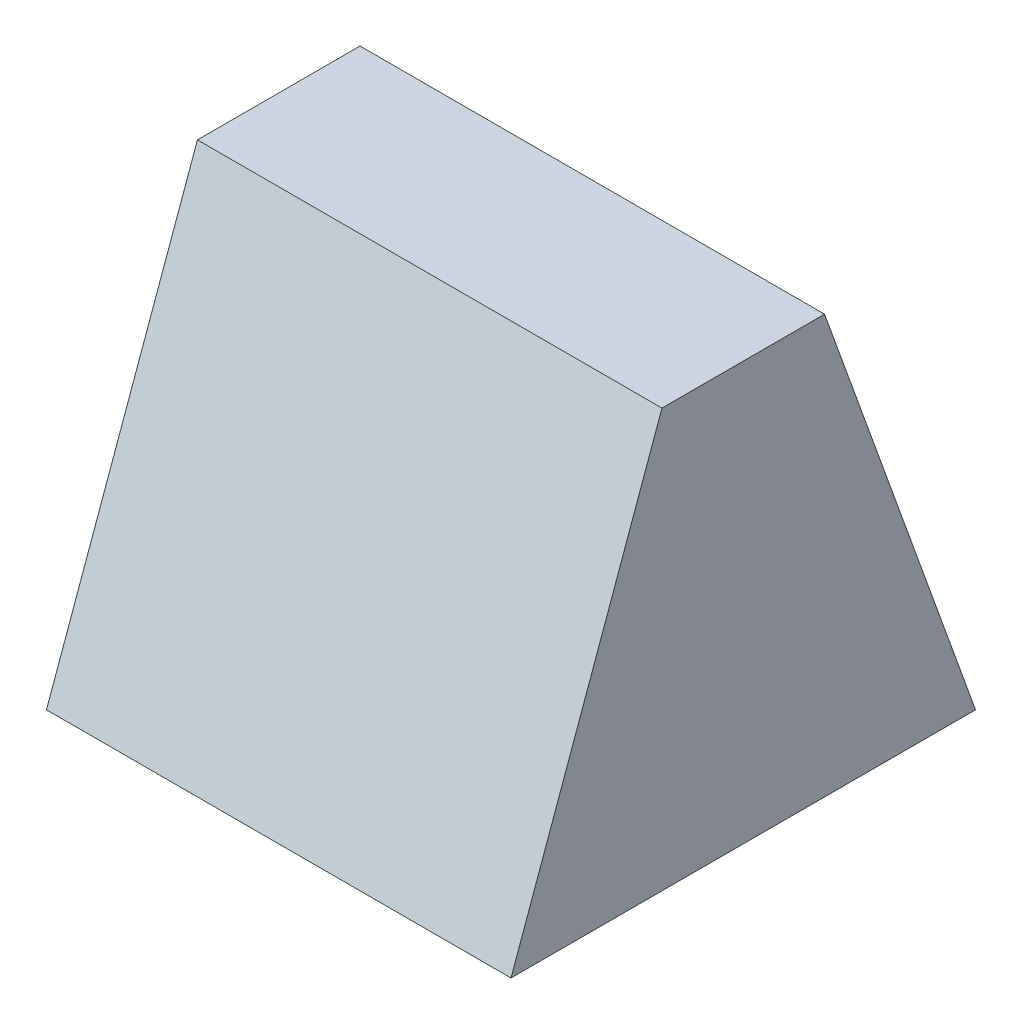
ISO-10303-21;
HEADER;
FILE_DESCRIPTION(('STEP AP214'),'2;1');
FILE_NAME('part.step','',(''),(''),'','','');
FILE_SCHEMA(('AUTOMOTIVE_DESIGN { 1 0 10303 214 1 1 1 1 }'));
ENDSEC;
DATA;
#1=APPLICATION_CONTEXT('core data for automotive mechanical design processes');
#2=APPLICATION_PROTOCOL_DEFINITION('international standard','automotive_design',2000,#1);
#3=PRODUCT_CONTEXT('',#1,'mechanical');
#4=PRODUCT('Part','Part','',(#3));
#5=PRODUCT_RELATED_PRODUCT_CATEGORY('part','',(#4));
#6=PRODUCT_DEFINITION_FORMATION('','',#4);
#7=PRODUCT_DEFINITION_CONTEXT('part definition',#1,'design');
#8=PRODUCT_DEFINITION('design','',#6,#7);
#9=PRODUCT_DEFINITION_SHAPE('','',#8);
#10=(LENGTH_UNIT() NAMED_UNIT(*) SI_UNIT(.MILLI.,.METRE.));
#11=(NAMED_UNIT(*) PLANE_ANGLE_UNIT() SI_UNIT($,.RADIAN.));
#12=(NAMED_UNIT(*) SI_UNIT($,.STERADIAN.) SOLID_ANGLE_UNIT());
#13=UNCERTAINTY_MEASURE_WITH_UNIT(LENGTH_MEASURE(1.E-05),#10,'distance_accuracy_value','');
#14=(GEOMETRIC_REPRESENTATION_CONTEXT(3) GLOBAL_UNCERTAINTY_ASSIGNED_CONTEXT((#13)) GLOBAL_UNIT_ASSIGNED_CONTEXT((#10,
#11,#12)) REPRESENTATION_CONTEXT('',''));
#15=CARTESIAN_POINT('',(0.,0.,0.));
#16=DIRECTION('',(0.,0.,1.));
#17=DIRECTION('',(1.,0.,0.));
#18=AXIS2_PLACEMENT_3D('',#15,#16,#17);
#19=CARTESIAN_POINT('',(-10.,-33.9259071882282,-179.19725595501));
#20=DIRECTION('',(0.,-0.339644463777557,-0.940553899691695));
#21=DIRECTION('',(0.,0.940553899691696,-0.339644463777557));
#22=AXIS2_PLACEMENT_3D('',#19,#20,#21);
#23=PLANE('',#22);
#24=DIRECTION('',(0.,0.940553899691695,-0.339644463777557));
#25=VECTOR('',#24,1.);
#26=CARTESIAN_POINT('',(0.,-33.9259071882282,-179.19725595501));
#27=LINE('',#26,#25);
#28=CARTESIAN_POINT('',(0.,-42.9259071882282,-175.94725595501));
#29=VERTEX_POINT('',#28);
#30=CARTESIAN_POINT('',(0.,-33.9259071882282,-179.19725595501));
#31=VERTEX_POINT('',#30);
#32=EDGE_CURVE('E96',#29,#31,#27,.T.);
#33=ORIENTED_EDGE('',*,*,#32,.T.);
#34=DIRECTION('',(1.,0.,0.));
#35=VECTOR('',#34,1.);
#36=CARTESIAN_POINT('',(-10.,-33.9259071882282,-179.19725595501));
#37=LINE('',#36,#35);
#38=CARTESIAN_POINT('',(-10.,-33.9259071882282,-179.19725595501));
#39=VERTEX_POINT('',#38);
#40=EDGE_CURVE('E11',#39,#31,#37,.T.);
#41=ORIENTED_EDGE('',*,*,#40,.F.);
#42=DIRECTION('',(0.,0.940553899691695,-0.339644463777557));
#43=VECTOR('',#42,1.);
#44=CARTESIAN_POINT('',(-10.,-33.9259071882282,-179.19725595501));
#45=LINE('',#44,#43);
#46=CARTESIAN_POINT('',(-10.,-42.9259071882282,-175.94725595501));
#47=VERTEX_POINT('',#46);
#48=EDGE_CURVE('E84',#47,#39,#45,.T.);
#49=ORIENTED_EDGE('',*,*,#48,.F.);
#50=DIRECTION('',(1.,0.,0.));
#51=VECTOR('',#50,1.);
#52=CARTESIAN_POINT('',(-10.,-42.9259071882282,-175.94725595501));
#53=LINE('',#52,#51);
#54=EDGE_CURVE('E92',#47,#29,#53,.T.);
#55=ORIENTED_EDGE('',*,*,#54,.T.);
#56=EDGE_LOOP('',(#33,#41,#49,#55));
#57=FACE_BOUND('',#56,.T.);
#58=ADVANCED_FACE('F33',(#57),#23,.F.);
#59=CARTESIAN_POINT('',(-10.,-33.9259071882282,-182.69725595501));
#60=DIRECTION('',(0.,-1.,0.));
#61=DIRECTION('',(0.,0.,-1.));
#62=AXIS2_PLACEMENT_3D('',#59,#60,#61);
#63=PLANE('',#62);
#64=DIRECTION('',(0.,0.,-1.));
#65=VECTOR('',#64,1.);
#66=CARTESIAN_POINT('',(0.,-33.9259071882282,-182.69725595501));
#67=LINE('',#66,#65);
#68=CARTESIAN_POINT('',(0.,-33.9259071882282,-182.69725595501));
#69=VERTEX_POINT('',#68);
#70=EDGE_CURVE('E88',#31,#69,#67,.T.);
#71=ORIENTED_EDGE('',*,*,#70,.T.);
#72=DIRECTION('',(1.,0.,0.));
#73=VECTOR('',#72,1.);
#74=CARTESIAN_POINT('',(-10.,-33.9259071882282,-182.69725595501));
#75=LINE('',#74,#73);
#76=CARTESIAN_POINT('',(-10.,-33.9259071882282,-182.69725595501));
#77=VERTEX_POINT('',#76);
#78=EDGE_CURVE('E41',#77,#69,#75,.T.);
#79=ORIENTED_EDGE('',*,*,#78,.F.);
#80=DIRECTION('',(0.,0.,-1.));
#81=VECTOR('',#80,1.);
#82=CARTESIAN_POINT('',(-10.,-33.9259071882282,-182.69725595501));
#83=LINE('',#82,#81);
#84=EDGE_CURVE('E79',#39,#77,#83,.T.);
#85=ORIENTED_EDGE('',*,*,#84,.F.);
#86=ORIENTED_EDGE('',*,*,#40,.T.);
#87=EDGE_LOOP('',(#71,#79,#85,#86));
#88=FACE_BOUND('',#87,.T.);
#89=ADVANCED_FACE('F87',(#88),#63,.F.);
#90=CARTESIAN_POINT('',(-10.,-42.9259071882282,-185.94725595501));
#91=DIRECTION('',(0.,-0.339644463777557,0.940553899691695));
#92=DIRECTION('',(0.,-0.940553899691696,-0.339644463777557));
#93=AXIS2_PLACEMENT_3D('',#90,#91,#92);
#94=PLANE('',#93);
#95=DIRECTION('',(0.,-0.940553899691695,-0.339644463777557));
#96=VECTOR('',#95,1.);
#97=CARTESIAN_POINT('',(0.,-42.9259071882282,-185.94725595501));
#98=LINE('',#97,#96);
#99=CARTESIAN_POINT('',(0.,-42.9259071882282,-185.94725595501));
#100=VERTEX_POINT('',#99);
#101=EDGE_CURVE('E66',#69,#100,#98,.T.);
#102=ORIENTED_EDGE('',*,*,#101,.T.);
#103=DIRECTION('',(1.,0.,0.));
#104=VECTOR('',#103,1.);
#105=CARTESIAN_POINT('',(-10.,-42.9259071882282,-185.94725595501));
#106=LINE('',#105,#104);
#107=CARTESIAN_POINT('',(-10.,-42.9259071882282,-185.94725595501));
#108=VERTEX_POINT('',#107);
#109=EDGE_CURVE('E89',#108,#100,#106,.T.);
#110=ORIENTED_EDGE('',*,*,#109,.F.);
#111=DIRECTION('',(0.,-0.940553899691695,-0.339644463777557));
#112=VECTOR('',#111,1.);
#113=CARTESIAN_POINT('',(-10.,-42.9259071882282,-185.94725595501));
#114=LINE('',#113,#112);
#115=EDGE_CURVE('E82',#77,#108,#114,.T.);
#116=ORIENTED_EDGE('',*,*,#115,.F.);
#117=ORIENTED_EDGE('',*,*,#78,.T.);
#118=EDGE_LOOP('',(#102,#110,#116,#117));
#119=FACE_BOUND('',#118,.T.);
#120=ADVANCED_FACE('F90',(#119),#94,.F.);
#121=CARTESIAN_POINT('',(-10.,-42.9259071882282,-175.94725595501));
#122=DIRECTION('',(0.,1.,0.));
#123=DIRECTION('',(0.,0.,1.));
#124=AXIS2_PLACEMENT_3D('',#121,#122,#123);
#125=PLANE('',#124);
#126=DIRECTION('',(0.,0.,1.));
#127=VECTOR('',#126,1.);
#128=CARTESIAN_POINT('',(0.,-42.9259071882282,-175.94725595501));
#129=LINE('',#128,#127);
#130=EDGE_CURVE('E72',#100,#29,#129,.T.);
#131=ORIENTED_EDGE('',*,*,#130,.T.);
#132=ORIENTED_EDGE('',*,*,#54,.F.);
#133=DIRECTION('',(0.,0.,1.));
#134=VECTOR('',#133,1.);
#135=CARTESIAN_POINT('',(-10.,-42.9259071882282,-175.94725595501));
#136=LINE('',#135,#134);
#137=EDGE_CURVE('E49',#108,#47,#136,.T.);
#138=ORIENTED_EDGE('',*,*,#137,.F.);
#139=ORIENTED_EDGE('',*,*,#109,.T.);
#140=EDGE_LOOP('',(#131,#132,#138,#139));
#141=FACE_BOUND('',#140,.T.);
#142=ADVANCED_FACE('F103',(#141),#125,.F.);
#143=CARTESIAN_POINT('',(-10.,0.,0.));
#144=DIRECTION('',(1.,0.,0.));
#145=DIRECTION('',(0.,0.,-1.));
#146=AXIS2_PLACEMENT_3D('',#143,#144,#145);
#147=PLANE('',#146);
#148=ORIENTED_EDGE('',*,*,#48,.T.);
#149=ORIENTED_EDGE('',*,*,#84,.T.);
#150=ORIENTED_EDGE('',*,*,#115,.T.);
#151=ORIENTED_EDGE('',*,*,#137,.T.);
#152=EDGE_LOOP('',(#148,#149,#150,#151));
#153=FACE_BOUND('',#152,.T.);
#154=ADVANCED_FACE('F80',(#153),#147,.F.);
#155=CARTESIAN_POINT('',(0.,0.,0.));
#156=DIRECTION('',(1.,0.,0.));
#157=DIRECTION('',(0.,0.,-1.));
#158=AXIS2_PLACEMENT_3D('',#155,#156,#157);
#159=PLANE('',#158);
#160=ORIENTED_EDGE('',*,*,#32,.F.);
#161=ORIENTED_EDGE('',*,*,#130,.F.);
#162=ORIENTED_EDGE('',*,*,#101,.F.);
#163=ORIENTED_EDGE('',*,*,#70,.F.);
#164=EDGE_LOOP('',(#160,#161,#162,#163));
#165=FACE_BOUND('',#164,.T.);
#166=ADVANCED_FACE('F106',(#165),#159,.T.);
#167=CLOSED_SHELL('',(#58,#89,#120,#142,#154,#166));
#168=MANIFOLD_SOLID_BREP('B2',#167);
#169=ADVANCED_BREP_SHAPE_REPRESENTATION('',(#18,#168),#14);
#170=SHAPE_DEFINITION_REPRESENTATION(#9,#169);
ENDSEC;
END-ISO-10303-21;
